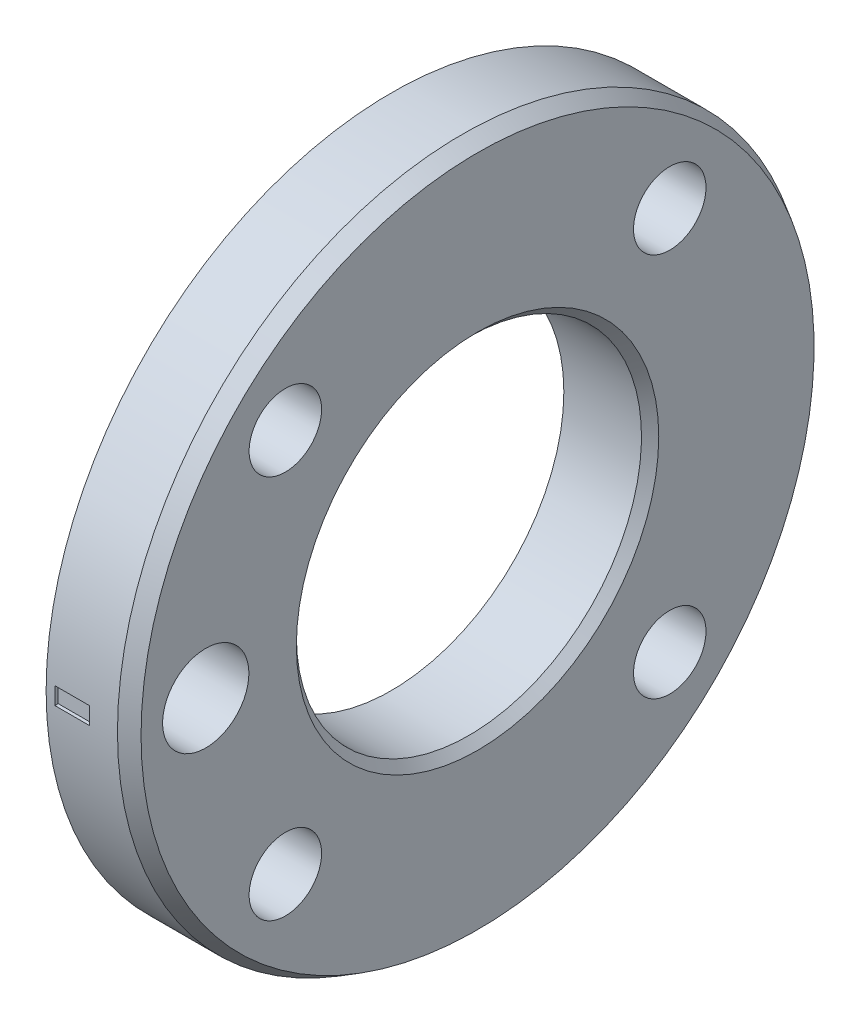
ISO-10303-21;
HEADER;
FILE_DESCRIPTION(('STEP AP214'),'2;1');
FILE_NAME('part.step','',(''),(''),'','','');
FILE_SCHEMA(('AUTOMOTIVE_DESIGN { 1 0 10303 214 1 1 1 1 }'));
ENDSEC;
DATA;
#1=APPLICATION_CONTEXT('core data for automotive mechanical design processes');
#2=APPLICATION_PROTOCOL_DEFINITION('international standard','automotive_design',2000,#1);
#3=PRODUCT_CONTEXT('',#1,'mechanical');
#4=PRODUCT('Part','Part','',(#3));
#5=PRODUCT_RELATED_PRODUCT_CATEGORY('part','',(#4));
#6=PRODUCT_DEFINITION_FORMATION('','',#4);
#7=PRODUCT_DEFINITION_CONTEXT('part definition',#1,'design');
#8=PRODUCT_DEFINITION('design','',#6,#7);
#9=PRODUCT_DEFINITION_SHAPE('','',#8);
#10=(LENGTH_UNIT() NAMED_UNIT(*) SI_UNIT(.MILLI.,.METRE.));
#11=(NAMED_UNIT(*) PLANE_ANGLE_UNIT() SI_UNIT($,.RADIAN.));
#12=(NAMED_UNIT(*) SI_UNIT($,.STERADIAN.) SOLID_ANGLE_UNIT());
#13=UNCERTAINTY_MEASURE_WITH_UNIT(LENGTH_MEASURE(1.E-05),#10,'distance_accuracy_value','');
#14=(GEOMETRIC_REPRESENTATION_CONTEXT(3) GLOBAL_UNCERTAINTY_ASSIGNED_CONTEXT((#13)) GLOBAL_UNIT_ASSIGNED_CONTEXT((#10,
#11,#12)) REPRESENTATION_CONTEXT('',''));
#15=CARTESIAN_POINT('',(0.,0.,0.));
#16=DIRECTION('',(0.,0.,1.));
#17=DIRECTION('',(1.,0.,0.));
#18=AXIS2_PLACEMENT_3D('',#15,#16,#17);
#19=CARTESIAN_POINT('',(498.,3.16816017864596E-13,908.9));
#20=DIRECTION('',(0.,0.,-1.));
#21=DIRECTION('',(0.,1.,0.));
#22=AXIS2_PLACEMENT_3D('',#19,#20,#21);
#23=PLANE('',#22);
#24=DIRECTION('',(1.,0.,0.));
#25=VECTOR('',#24,1.);
#26=CARTESIAN_POINT('',(528.5,0.500000000000311,908.9));
#27=LINE('',#26,#25);
#28=CARTESIAN_POINT('',(530.5,0.50000000000031,908.9));
#29=VERTEX_POINT('',#28);
#30=CARTESIAN_POINT('',(528.5,0.500000000000311,908.9));
#31=VERTEX_POINT('',#30);
#32=EDGE_CURVE('E131',#29,#31,#27,.F.);
#33=ORIENTED_EDGE('',*,*,#32,.T.);
#34=DIRECTION('',(0.,1.,0.));
#35=VECTOR('',#34,1.);
#36=CARTESIAN_POINT('',(528.5,-0.499999999999689,908.9));
#37=LINE('',#36,#35);
#38=CARTESIAN_POINT('',(528.5,-0.499999999999689,908.9));
#39=VERTEX_POINT('',#38);
#40=EDGE_CURVE('E53',#31,#39,#37,.F.);
#41=ORIENTED_EDGE('',*,*,#40,.T.);
#42=DIRECTION('',(1.,0.,0.));
#43=VECTOR('',#42,1.);
#44=CARTESIAN_POINT('',(528.5,-0.499999999999689,908.9));
#45=LINE('',#44,#43);
#46=CARTESIAN_POINT('',(530.5,-0.499999999999689,908.9));
#47=VERTEX_POINT('',#46);
#48=EDGE_CURVE('E73',#39,#47,#45,.T.);
#49=ORIENTED_EDGE('',*,*,#48,.T.);
#50=DIRECTION('',(0.,1.,0.));
#51=VECTOR('',#50,1.);
#52=CARTESIAN_POINT('',(530.5,-0.49999999999969,908.9));
#53=LINE('',#52,#51);
#54=EDGE_CURVE('E64',#47,#29,#53,.T.);
#55=ORIENTED_EDGE('',*,*,#54,.T.);
#56=EDGE_LOOP('',(#33,#41,#49,#55));
#57=FACE_BOUND('',#56,.T.);
#58=ADVANCED_FACE('F16',(#57),#23,.F.);
#59=CARTESIAN_POINT('',(530.5,-0.49999999999969,908.9));
#60=DIRECTION('',(1.,0.,0.));
#61=DIRECTION('',(0.,0.,-1.));
#62=AXIS2_PLACEMENT_3D('',#59,#60,#61);
#63=PLANE('',#62);
#64=DIRECTION('',(0.,0.,1.));
#65=VECTOR('',#64,1.);
#66=CARTESIAN_POINT('',(530.5,0.500000000000311,908.9));
#67=LINE('',#66,#65);
#68=CARTESIAN_POINT('',(530.5,0.500000000000318,909.093749023132));
#69=VERTEX_POINT('',#68);
#70=EDGE_CURVE('E45',#69,#29,#67,.F.);
#71=ORIENTED_EDGE('',*,*,#70,.T.);
#72=ORIENTED_EDGE('',*,*,#54,.F.);
#73=DIRECTION('',(0.,0.,-1.));
#74=VECTOR('',#73,1.);
#75=CARTESIAN_POINT('',(530.5,-0.49999999999969,908.9));
#76=LINE('',#75,#74);
#77=CARTESIAN_POINT('',(530.5,-0.499999999999684,909.093749023132));
#78=VERTEX_POINT('',#77);
#79=EDGE_CURVE('E68',#47,#78,#76,.F.);
#80=ORIENTED_EDGE('',*,*,#79,.T.);
#81=CARTESIAN_POINT('',(530.5,0.,889.1));
#82=DIRECTION('',(1.,0.,0.));
#83=DIRECTION('',(0.,0.,-1.));
#84=AXIS2_PLACEMENT_3D('',#81,#82,#83);
#85=CIRCLE('',#84,20.);
#86=EDGE_CURVE('E113',#69,#78,#85,.T.);
#87=ORIENTED_EDGE('',*,*,#86,.F.);
#88=EDGE_LOOP('',(#71,#72,#80,#87));
#89=FACE_BOUND('',#88,.T.);
#90=ADVANCED_FACE('F66',(#89),#63,.F.);
#91=CARTESIAN_POINT('',(528.5,-0.499999999999689,908.9));
#92=DIRECTION('',(0.,-1.,0.));
#93=DIRECTION('',(0.,0.,-1.));
#94=AXIS2_PLACEMENT_3D('',#91,#92,#93);
#95=PLANE('',#94);
#96=ORIENTED_EDGE('',*,*,#79,.F.);
#97=ORIENTED_EDGE('',*,*,#48,.F.);
#98=DIRECTION('',(0.,0.,1.));
#99=VECTOR('',#98,1.);
#100=CARTESIAN_POINT('',(528.5,-0.499999999999689,908.9));
#101=LINE('',#100,#99);
#102=CARTESIAN_POINT('',(528.5,-0.499999999999685,909.093749023132));
#103=VERTEX_POINT('',#102);
#104=EDGE_CURVE('E143',#39,#103,#101,.T.);
#105=ORIENTED_EDGE('',*,*,#104,.T.);
#106=DIRECTION('',(1.,0.,0.));
#107=VECTOR('',#106,1.);
#108=CARTESIAN_POINT('',(532.84565955403,-0.499999999999683,909.093749023132));
#109=LINE('',#108,#107);
#110=EDGE_CURVE('E78',#78,#103,#109,.F.);
#111=ORIENTED_EDGE('',*,*,#110,.F.);
#112=EDGE_LOOP('',(#96,#97,#105,#111));
#113=FACE_BOUND('',#112,.T.);
#114=ADVANCED_FACE('F76',(#113),#95,.F.);
#115=CARTESIAN_POINT('',(528.5,-0.499999999999689,908.9));
#116=DIRECTION('',(-1.,0.,0.));
#117=DIRECTION('',(0.,0.,1.));
#118=AXIS2_PLACEMENT_3D('',#115,#116,#117);
#119=PLANE('',#118);
#120=ORIENTED_EDGE('',*,*,#104,.F.);
#121=ORIENTED_EDGE('',*,*,#40,.F.);
#122=DIRECTION('',(0.,0.,1.));
#123=VECTOR('',#122,1.);
#124=CARTESIAN_POINT('',(528.5,0.500000000000311,908.9));
#125=LINE('',#124,#123);
#126=CARTESIAN_POINT('',(528.5,0.500000000000318,909.093749023132));
#127=VERTEX_POINT('',#126);
#128=EDGE_CURVE('E128',#31,#127,#125,.T.);
#129=ORIENTED_EDGE('',*,*,#128,.T.);
#130=CARTESIAN_POINT('',(528.5,0.,889.1));
#131=DIRECTION('',(1.,0.,0.));
#132=DIRECTION('',(0.,0.,-1.));
#133=AXIS2_PLACEMENT_3D('',#130,#131,#132);
#134=CIRCLE('',#133,20.);
#135=EDGE_CURVE('E34',#103,#127,#134,.F.);
#136=ORIENTED_EDGE('',*,*,#135,.F.);
#137=EDGE_LOOP('',(#120,#121,#129,#136));
#138=FACE_BOUND('',#137,.T.);
#139=ADVANCED_FACE('F209',(#138),#119,.F.);
#140=CARTESIAN_POINT('',(528.5,0.500000000000311,908.9));
#141=DIRECTION('',(0.,1.,0.));
#142=DIRECTION('',(0.,0.,1.));
#143=AXIS2_PLACEMENT_3D('',#140,#141,#142);
#144=PLANE('',#143);
#145=ORIENTED_EDGE('',*,*,#128,.F.);
#146=ORIENTED_EDGE('',*,*,#32,.F.);
#147=ORIENTED_EDGE('',*,*,#70,.F.);
#148=DIRECTION('',(1.,0.,0.));
#149=VECTOR('',#148,1.);
#150=CARTESIAN_POINT('',(532.84565955403,0.500000000000321,909.093749023132));
#151=LINE('',#150,#149);
#152=EDGE_CURVE('E112',#127,#69,#151,.T.);
#153=ORIENTED_EDGE('',*,*,#152,.F.);
#154=EDGE_LOOP('',(#145,#146,#147,#153));
#155=FACE_BOUND('',#154,.T.);
#156=ADVANCED_FACE('F206',(#155),#144,.F.);
#157=CARTESIAN_POINT('',(532.133974596216,0.,889.1));
#158=DIRECTION('',(-1.,0.,0.));
#159=DIRECTION('',(0.,0.,1.));
#160=AXIS2_PLACEMENT_3D('',#157,#158,#159);
#161=CONICAL_SURFACE('',#160,20.,0.5235987755983);
#162=CARTESIAN_POINT('',(533.,0.,889.1));
#163=DIRECTION('',(-1.,0.,0.));
#164=DIRECTION('',(0.,0.,1.));
#165=AXIS2_PLACEMENT_3D('',#162,#163,#164);
#166=CIRCLE('',#165,19.5000000000002);
#167=CARTESIAN_POINT('',(533.,0.,908.6));
#168=VERTEX_POINT('',#167);
#169=EDGE_CURVE('E19',#168,#168,#166,.T.);
#170=ORIENTED_EDGE('',*,*,#169,.T.);
#171=EDGE_LOOP('',(#170));
#172=FACE_BOUND('',#171,.T.);
#173=CARTESIAN_POINT('',(532.133974596216,0.,889.1));
#174=DIRECTION('',(1.,0.,0.));
#175=DIRECTION('',(0.,0.,-1.));
#176=AXIS2_PLACEMENT_3D('',#173,#174,#175);
#177=CIRCLE('',#176,20.);
#178=CARTESIAN_POINT('',(532.133974596216,0.,869.1));
#179=VERTEX_POINT('',#178);
#180=EDGE_CURVE('E110',#179,#179,#177,.F.);
#181=ORIENTED_EDGE('',*,*,#180,.F.);
#182=EDGE_LOOP('',(#181));
#183=FACE_BOUND('',#182,.T.);
#184=ADVANCED_FACE('F202',(#172,#183),#161,.T.);
#185=CARTESIAN_POINT('',(533.,0.,894.35));
#186=DIRECTION('',(-1.,0.,0.));
#187=DIRECTION('',(0.,0.,1.));
#188=AXIS2_PLACEMENT_3D('',#185,#186,#187);
#189=PLANE('',#188);
#190=ORIENTED_EDGE('',*,*,#169,.F.);
#191=EDGE_LOOP('',(#190));
#192=FACE_BOUND('',#191,.T.);
#193=CARTESIAN_POINT('',(533.,0.,889.1));
#194=DIRECTION('',(1.,0.,0.));
#195=DIRECTION('',(0.,1.,0.));
#196=AXIS2_PLACEMENT_3D('',#193,#194,#195);
#197=CIRCLE('',#196,10.4999999999999);
#198=CARTESIAN_POINT('',(533.,10.4999999999999,889.1));
#199=VERTEX_POINT('',#198);
#200=EDGE_CURVE('E123',#199,#199,#197,.F.);
#201=ORIENTED_EDGE('',*,*,#200,.T.);
#202=EDGE_LOOP('',(#201));
#203=FACE_BOUND('',#202,.T.);
#204=CARTESIAN_POINT('',(533.,11.1369318036882,900.236931803688));
#205=DIRECTION('',(1.,0.,0.));
#206=DIRECTION('',(0.,0.,-1.));
#207=AXIS2_PLACEMENT_3D('',#204,#205,#206);
#208=CIRCLE('',#207,2.1);
#209=CARTESIAN_POINT('',(533.,11.1369318036882,898.136931803688));
#210=VERTEX_POINT('',#209);
#211=EDGE_CURVE('E121',#210,#210,#208,.F.);
#212=ORIENTED_EDGE('',*,*,#211,.T.);
#213=EDGE_LOOP('',(#212));
#214=FACE_BOUND('',#213,.T.);
#215=CARTESIAN_POINT('',(533.,-11.1369318036881,900.236931803688));
#216=DIRECTION('',(1.,0.,0.));
#217=DIRECTION('',(0.,0.,-1.));
#218=AXIS2_PLACEMENT_3D('',#215,#216,#217);
#219=CIRCLE('',#218,2.1);
#220=CARTESIAN_POINT('',(533.,-11.1369318036881,898.136931803688));
#221=VERTEX_POINT('',#220);
#222=EDGE_CURVE('E104',#221,#221,#219,.F.);
#223=ORIENTED_EDGE('',*,*,#222,.T.);
#224=EDGE_LOOP('',(#223));
#225=FACE_BOUND('',#224,.T.);
#226=CARTESIAN_POINT('',(533.,-11.1369318036883,877.963068196312));
#227=DIRECTION('',(1.,0.,0.));
#228=DIRECTION('',(0.,0.,-1.));
#229=AXIS2_PLACEMENT_3D('',#226,#227,#228);
#230=CIRCLE('',#229,2.1);
#231=CARTESIAN_POINT('',(533.,-11.1369318036883,875.863068196312));
#232=VERTEX_POINT('',#231);
#233=EDGE_CURVE('E118',#232,#232,#230,.F.);
#234=ORIENTED_EDGE('',*,*,#233,.T.);
#235=EDGE_LOOP('',(#234));
#236=FACE_BOUND('',#235,.T.);
#237=CARTESIAN_POINT('',(533.,11.136931803688,877.963068196312));
#238=DIRECTION('',(1.,0.,0.));
#239=DIRECTION('',(0.,0.,-1.));
#240=AXIS2_PLACEMENT_3D('',#237,#238,#239);
#241=CIRCLE('',#240,2.1);
#242=CARTESIAN_POINT('',(533.,11.136931803688,875.863068196312));
#243=VERTEX_POINT('',#242);
#244=EDGE_CURVE('E107',#243,#243,#241,.F.);
#245=ORIENTED_EDGE('',*,*,#244,.T.);
#246=EDGE_LOOP('',(#245));
#247=FACE_BOUND('',#246,.T.);
#248=CARTESIAN_POINT('',(533.,2.35500132891329E-13,904.85));
#249=DIRECTION('',(1.,0.,0.));
#250=DIRECTION('',(0.,0.,-1.));
#251=AXIS2_PLACEMENT_3D('',#248,#249,#250);
#252=CIRCLE('',#251,2.5);
#253=CARTESIAN_POINT('',(533.,2.35500132891329E-13,902.35));
#254=VERTEX_POINT('',#253);
#255=EDGE_CURVE('E115',#254,#254,#252,.F.);
#256=ORIENTED_EDGE('',*,*,#255,.T.);
#257=EDGE_LOOP('',(#256));
#258=FACE_BOUND('',#257,.T.);
#259=ADVANCED_FACE('F198',(#192,#203,#214,#225,#236,#247,#258),#189,.F.);
#260=CARTESIAN_POINT('',(533.,0.,889.1));
#261=DIRECTION('',(1.,0.,0.));
#262=DIRECTION('',(0.,1.,0.));
#263=AXIS2_PLACEMENT_3D('',#260,#261,#262);
#264=CONICAL_SURFACE('',#263,10.5000000000001,0.785398163397419);
#265=ORIENTED_EDGE('',*,*,#200,.F.);
#266=EDGE_LOOP('',(#265));
#267=FACE_BOUND('',#266,.T.);
#268=CARTESIAN_POINT('',(532.5,0.,889.1));
#269=DIRECTION('',(-1.,0.,0.));
#270=DIRECTION('',(0.,0.,1.));
#271=AXIS2_PLACEMENT_3D('',#268,#269,#270);
#272=CIRCLE('',#271,10.);
#273=CARTESIAN_POINT('',(532.5,0.,899.1));
#274=VERTEX_POINT('',#273);
#275=EDGE_CURVE('E103',#274,#274,#272,.T.);
#276=ORIENTED_EDGE('',*,*,#275,.T.);
#277=EDGE_LOOP('',(#276));
#278=FACE_BOUND('',#277,.T.);
#279=ADVANCED_FACE('F158',(#267,#278),#264,.F.);
#280=CARTESIAN_POINT('',(533.,11.1369318036882,900.236931803688));
#281=DIRECTION('',(1.,0.,0.));
#282=DIRECTION('',(0.,0.,-1.));
#283=AXIS2_PLACEMENT_3D('',#280,#281,#282);
#284=CYLINDRICAL_SURFACE('',#283,2.1);
#285=ORIENTED_EDGE('',*,*,#211,.F.);
#286=EDGE_LOOP('',(#285));
#287=FACE_BOUND('',#286,.T.);
#288=CARTESIAN_POINT('',(528.,11.1369318036882,900.236931803688));
#289=DIRECTION('',(1.,0.,0.));
#290=DIRECTION('',(0.,0.,-1.));
#291=AXIS2_PLACEMENT_3D('',#288,#289,#290);
#292=CIRCLE('',#291,2.1);
#293=CARTESIAN_POINT('',(528.,11.1369318036882,898.136931803688));
#294=VERTEX_POINT('',#293);
#295=EDGE_CURVE('E100',#294,#294,#292,.F.);
#296=ORIENTED_EDGE('',*,*,#295,.T.);
#297=EDGE_LOOP('',(#296));
#298=FACE_BOUND('',#297,.T.);
#299=ADVANCED_FACE('F191',(#287,#298),#284,.F.);
#300=CARTESIAN_POINT('',(533.,-11.1369318036883,877.963068196312));
#301=DIRECTION('',(1.,0.,0.));
#302=DIRECTION('',(0.,0.,-1.));
#303=AXIS2_PLACEMENT_3D('',#300,#301,#302);
#304=CYLINDRICAL_SURFACE('',#303,2.1);
#305=ORIENTED_EDGE('',*,*,#233,.F.);
#306=EDGE_LOOP('',(#305));
#307=FACE_BOUND('',#306,.T.);
#308=CARTESIAN_POINT('',(528.,-11.1369318036883,877.963068196312));
#309=DIRECTION('',(1.,0.,0.));
#310=DIRECTION('',(0.,0.,-1.));
#311=AXIS2_PLACEMENT_3D('',#308,#309,#310);
#312=CIRCLE('',#311,2.1);
#313=CARTESIAN_POINT('',(528.,-11.1369318036883,875.863068196312));
#314=VERTEX_POINT('',#313);
#315=EDGE_CURVE('E97',#314,#314,#312,.F.);
#316=ORIENTED_EDGE('',*,*,#315,.T.);
#317=EDGE_LOOP('',(#316));
#318=FACE_BOUND('',#317,.T.);
#319=ADVANCED_FACE('F187',(#307,#318),#304,.F.);
#320=CARTESIAN_POINT('',(533.,2.35500132891329E-13,904.85));
#321=DIRECTION('',(1.,0.,0.));
#322=DIRECTION('',(0.,0.,-1.));
#323=AXIS2_PLACEMENT_3D('',#320,#321,#322);
#324=CYLINDRICAL_SURFACE('',#323,2.5);
#325=ORIENTED_EDGE('',*,*,#255,.F.);
#326=EDGE_LOOP('',(#325));
#327=FACE_BOUND('',#326,.T.);
#328=CARTESIAN_POINT('',(528.,2.36479859168099E-13,904.85));
#329=DIRECTION('',(1.,0.,0.));
#330=DIRECTION('',(0.,0.,-1.));
#331=AXIS2_PLACEMENT_3D('',#328,#329,#330);
#332=CIRCLE('',#331,2.5);
#333=CARTESIAN_POINT('',(528.,2.36479859168099E-13,902.35));
#334=VERTEX_POINT('',#333);
#335=EDGE_CURVE('E94',#334,#334,#332,.F.);
#336=ORIENTED_EDGE('',*,*,#335,.T.);
#337=EDGE_LOOP('',(#336));
#338=FACE_BOUND('',#337,.T.);
#339=ADVANCED_FACE('F183',(#327,#338),#324,.F.);
#340=CARTESIAN_POINT('',(532.84565955403,0.,889.1));
#341=DIRECTION('',(1.,0.,0.));
#342=DIRECTION('',(0.,0.,-1.));
#343=AXIS2_PLACEMENT_3D('',#340,#341,#342);
#344=CYLINDRICAL_SURFACE('',#343,20.);
#345=CARTESIAN_POINT('',(528.,0.,889.1));
#346=DIRECTION('',(1.,0.,0.));
#347=DIRECTION('',(0.,0.,-1.));
#348=AXIS2_PLACEMENT_3D('',#345,#346,#347);
#349=CIRCLE('',#348,20.);
#350=CARTESIAN_POINT('',(528.,0.,869.1));
#351=VERTEX_POINT('',#350);
#352=EDGE_CURVE('E91',#351,#351,#349,.T.);
#353=ORIENTED_EDGE('',*,*,#352,.T.);
#354=EDGE_LOOP('',(#353));
#355=FACE_BOUND('',#354,.T.);
#356=ORIENTED_EDGE('',*,*,#180,.T.);
#357=EDGE_LOOP('',(#356));
#358=FACE_BOUND('',#357,.T.);
#359=ORIENTED_EDGE('',*,*,#135,.T.);
#360=ORIENTED_EDGE('',*,*,#152,.T.);
#361=ORIENTED_EDGE('',*,*,#86,.T.);
#362=ORIENTED_EDGE('',*,*,#110,.T.);
#363=EDGE_LOOP('',(#359,#360,#361,#362));
#364=FACE_BOUND('',#363,.T.);
#365=ADVANCED_FACE('F179',(#355,#358,#364),#344,.T.);
#366=CARTESIAN_POINT('',(533.,11.136931803688,877.963068196312));
#367=DIRECTION('',(1.,0.,0.));
#368=DIRECTION('',(0.,0.,-1.));
#369=AXIS2_PLACEMENT_3D('',#366,#367,#368);
#370=CYLINDRICAL_SURFACE('',#369,2.1);
#371=ORIENTED_EDGE('',*,*,#244,.F.);
#372=EDGE_LOOP('',(#371));
#373=FACE_BOUND('',#372,.T.);
#374=CARTESIAN_POINT('',(528.,11.136931803688,877.963068196312));
#375=DIRECTION('',(1.,0.,0.));
#376=DIRECTION('',(0.,0.,-1.));
#377=AXIS2_PLACEMENT_3D('',#374,#375,#376);
#378=CIRCLE('',#377,2.1);
#379=CARTESIAN_POINT('',(528.,11.136931803688,875.863068196312));
#380=VERTEX_POINT('',#379);
#381=EDGE_CURVE('E88',#380,#380,#378,.F.);
#382=ORIENTED_EDGE('',*,*,#381,.T.);
#383=EDGE_LOOP('',(#382));
#384=FACE_BOUND('',#383,.T.);
#385=ADVANCED_FACE('F173',(#373,#384),#370,.F.);
#386=CARTESIAN_POINT('',(533.,-11.1369318036881,900.236931803688));
#387=DIRECTION('',(1.,0.,0.));
#388=DIRECTION('',(0.,0.,-1.));
#389=AXIS2_PLACEMENT_3D('',#386,#387,#388);
#390=CYLINDRICAL_SURFACE('',#389,2.1);
#391=ORIENTED_EDGE('',*,*,#222,.F.);
#392=EDGE_LOOP('',(#391));
#393=FACE_BOUND('',#392,.T.);
#394=CARTESIAN_POINT('',(528.,-11.1369318036881,900.236931803688));
#395=DIRECTION('',(1.,0.,0.));
#396=DIRECTION('',(0.,0.,-1.));
#397=AXIS2_PLACEMENT_3D('',#394,#395,#396);
#398=CIRCLE('',#397,2.1);
#399=CARTESIAN_POINT('',(528.,-11.1369318036881,898.136931803688));
#400=VERTEX_POINT('',#399);
#401=EDGE_CURVE('E25',#400,#400,#398,.F.);
#402=ORIENTED_EDGE('',*,*,#401,.T.);
#403=EDGE_LOOP('',(#402));
#404=FACE_BOUND('',#403,.T.);
#405=ADVANCED_FACE('F163',(#393,#404),#390,.F.);
#406=CARTESIAN_POINT('',(514.305,0.,889.1));
#407=DIRECTION('',(-1.,0.,0.));
#408=DIRECTION('',(0.,0.,1.));
#409=AXIS2_PLACEMENT_3D('',#406,#407,#408);
#410=CYLINDRICAL_SURFACE('',#409,10.);
#411=CARTESIAN_POINT('',(528.,0.,889.1));
#412=DIRECTION('',(-1.,0.,0.));
#413=DIRECTION('',(0.,0.,1.));
#414=AXIS2_PLACEMENT_3D('',#411,#412,#413);
#415=CIRCLE('',#414,10.);
#416=CARTESIAN_POINT('',(528.,0.,899.1));
#417=VERTEX_POINT('',#416);
#418=EDGE_CURVE('E11',#417,#417,#415,.T.);
#419=ORIENTED_EDGE('',*,*,#418,.T.);
#420=EDGE_LOOP('',(#419));
#421=FACE_BOUND('',#420,.T.);
#422=ORIENTED_EDGE('',*,*,#275,.F.);
#423=EDGE_LOOP('',(#422));
#424=FACE_BOUND('',#423,.T.);
#425=ADVANCED_FACE('F160',(#421,#424),#410,.F.);
#426=CARTESIAN_POINT('',(528.,0.,889.1));
#427=DIRECTION('',(1.,0.,0.));
#428=DIRECTION('',(0.,0.,-1.));
#429=AXIS2_PLACEMENT_3D('',#426,#427,#428);
#430=PLANE('',#429);
#431=ORIENTED_EDGE('',*,*,#418,.F.);
#432=EDGE_LOOP('',(#431));
#433=FACE_BOUND('',#432,.T.);
#434=ORIENTED_EDGE('',*,*,#401,.F.);
#435=EDGE_LOOP('',(#434));
#436=FACE_BOUND('',#435,.T.);
#437=ORIENTED_EDGE('',*,*,#381,.F.);
#438=EDGE_LOOP('',(#437));
#439=FACE_BOUND('',#438,.T.);
#440=ORIENTED_EDGE('',*,*,#352,.F.);
#441=EDGE_LOOP('',(#440));
#442=FACE_BOUND('',#441,.T.);
#443=ORIENTED_EDGE('',*,*,#335,.F.);
#444=EDGE_LOOP('',(#443));
#445=FACE_BOUND('',#444,.T.);
#446=ORIENTED_EDGE('',*,*,#315,.F.);
#447=EDGE_LOOP('',(#446));
#448=FACE_BOUND('',#447,.T.);
#449=ORIENTED_EDGE('',*,*,#295,.F.);
#450=EDGE_LOOP('',(#449));
#451=FACE_BOUND('',#450,.T.);
#452=ADVANCED_FACE('F162',(#433,#436,#439,#442,#445,#448,#451),#430,.F.);
#453=CLOSED_SHELL('',(#58,#90,#114,#139,#156,#184,#259,#279,#299,#319,#339,#365,#385,#405,#425,#452));
#454=MANIFOLD_SOLID_BREP('B1',#453);
#455=ADVANCED_BREP_SHAPE_REPRESENTATION('',(#18,#454),#14);
#456=SHAPE_DEFINITION_REPRESENTATION(#9,#455);
ENDSEC;
END-ISO-10303-21;
